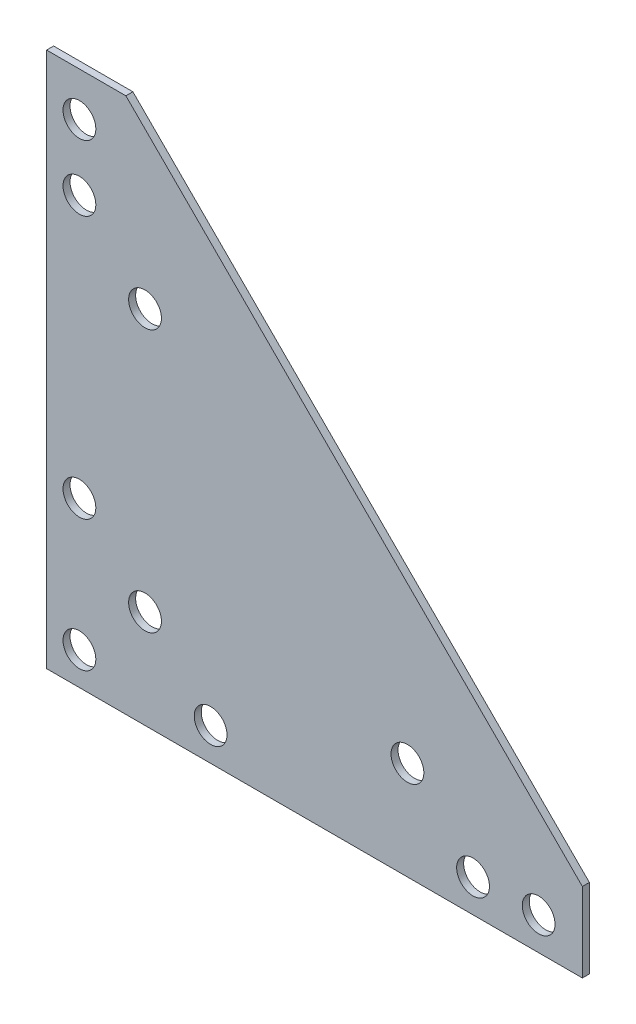
ISO-10303-21;
HEADER;
FILE_DESCRIPTION(('STEP AP214'),'2;1');
FILE_NAME('part.step','',(''),(''),'','','');
FILE_SCHEMA(('AUTOMOTIVE_DESIGN { 1 0 10303 214 1 1 1 1 }'));
ENDSEC;
DATA;
#1=APPLICATION_CONTEXT('core data for automotive mechanical design processes');
#2=APPLICATION_PROTOCOL_DEFINITION('international standard','automotive_design',2000,#1);
#3=PRODUCT_CONTEXT('',#1,'mechanical');
#4=PRODUCT('Part','Part','',(#3));
#5=PRODUCT_RELATED_PRODUCT_CATEGORY('part','',(#4));
#6=PRODUCT_DEFINITION_FORMATION('','',#4);
#7=PRODUCT_DEFINITION_CONTEXT('part definition',#1,'design');
#8=PRODUCT_DEFINITION('design','',#6,#7);
#9=PRODUCT_DEFINITION_SHAPE('','',#8);
#10=(LENGTH_UNIT() NAMED_UNIT(*) SI_UNIT(.MILLI.,.METRE.));
#11=(NAMED_UNIT(*) PLANE_ANGLE_UNIT() SI_UNIT($,.RADIAN.));
#12=(NAMED_UNIT(*) SI_UNIT($,.STERADIAN.) SOLID_ANGLE_UNIT());
#13=UNCERTAINTY_MEASURE_WITH_UNIT(LENGTH_MEASURE(1.E-05),#10,'distance_accuracy_value','');
#14=(GEOMETRIC_REPRESENTATION_CONTEXT(3) GLOBAL_UNCERTAINTY_ASSIGNED_CONTEXT((#13)) GLOBAL_UNIT_ASSIGNED_CONTEXT((#10,
#11,#12)) REPRESENTATION_CONTEXT('',''));
#15=CARTESIAN_POINT('',(0.,0.,0.));
#16=DIRECTION('',(0.,0.,1.));
#17=DIRECTION('',(1.,0.,0.));
#18=AXIS2_PLACEMENT_3D('',#15,#16,#17);
#19=CARTESIAN_POINT('',(77.7875,-54.76875,1.016));
#20=DIRECTION('',(-0.707106781186547,-0.707106781186548,0.));
#21=DIRECTION('',(0.707106781186548,-0.707106781186547,0.));
#22=AXIS2_PLACEMENT_3D('',#19,#20,#21);
#23=PLANE('',#22);
#24=DIRECTION('',(0.,0.,-1.));
#25=VECTOR('',#24,1.);
#26=CARTESIAN_POINT('',(77.7875,-54.76875,1.016));
#27=LINE('',#26,#25);
#28=CARTESIAN_POINT('',(77.7875,-54.76875,1.016));
#29=VERTEX_POINT('',#28);
#30=CARTESIAN_POINT('',(77.7875,-54.76875,-1.016));
#31=VERTEX_POINT('',#30);
#32=EDGE_CURVE('E101',#29,#31,#27,.T.);
#33=ORIENTED_EDGE('',*,*,#32,.T.);
#34=DIRECTION('',(-0.707106781186548,0.707106781186547,0.));
#35=VECTOR('',#34,1.);
#36=CARTESIAN_POINT('',(77.7875,-54.76875,-1.016));
#37=LINE('',#36,#35);
#38=CARTESIAN_POINT('',(-54.76875,77.7875,-1.016));
#39=VERTEX_POINT('',#38);
#40=EDGE_CURVE('E95',#31,#39,#37,.T.);
#41=ORIENTED_EDGE('',*,*,#40,.T.);
#42=DIRECTION('',(0.,0.,-1.));
#43=VECTOR('',#42,1.);
#44=CARTESIAN_POINT('',(-54.76875,77.7875,1.016));
#45=LINE('',#44,#43);
#46=CARTESIAN_POINT('',(-54.76875,77.7875,1.016));
#47=VERTEX_POINT('',#46);
#48=EDGE_CURVE('E11',#47,#39,#45,.T.);
#49=ORIENTED_EDGE('',*,*,#48,.F.);
#50=DIRECTION('',(-0.707106781186548,0.707106781186547,0.));
#51=VECTOR('',#50,1.);
#52=CARTESIAN_POINT('',(77.7875,-54.76875,1.016));
#53=LINE('',#52,#51);
#54=EDGE_CURVE('E117',#29,#47,#53,.T.);
#55=ORIENTED_EDGE('',*,*,#54,.F.);
#56=EDGE_LOOP('',(#33,#41,#49,#55));
#57=FACE_BOUND('',#56,.T.);
#58=ADVANCED_FACE('F37',(#57),#23,.F.);
#59=CARTESIAN_POINT('',(-54.76875,77.7875,1.016));
#60=DIRECTION('',(0.,-1.,0.));
#61=DIRECTION('',(1.,0.,0.));
#62=AXIS2_PLACEMENT_3D('',#59,#60,#61);
#63=PLANE('',#62);
#64=ORIENTED_EDGE('',*,*,#48,.T.);
#65=DIRECTION('',(-1.,0.,0.));
#66=VECTOR('',#65,1.);
#67=CARTESIAN_POINT('',(-54.76875,77.7875,-1.016));
#68=LINE('',#67,#66);
#69=CARTESIAN_POINT('',(-77.7875,77.7875,-1.016));
#70=VERTEX_POINT('',#69);
#71=EDGE_CURVE('E85',#39,#70,#68,.T.);
#72=ORIENTED_EDGE('',*,*,#71,.T.);
#73=DIRECTION('',(0.,0.,-1.));
#74=VECTOR('',#73,1.);
#75=CARTESIAN_POINT('',(-77.7875,77.7875,1.016));
#76=LINE('',#75,#74);
#77=CARTESIAN_POINT('',(-77.7875,77.7875,1.016));
#78=VERTEX_POINT('',#77);
#79=EDGE_CURVE('E44',#78,#70,#76,.T.);
#80=ORIENTED_EDGE('',*,*,#79,.F.);
#81=DIRECTION('',(-1.,0.,0.));
#82=VECTOR('',#81,1.);
#83=CARTESIAN_POINT('',(-54.76875,77.7875,1.016));
#84=LINE('',#83,#82);
#85=EDGE_CURVE('E86',#47,#78,#84,.T.);
#86=ORIENTED_EDGE('',*,*,#85,.F.);
#87=EDGE_LOOP('',(#64,#72,#80,#86));
#88=FACE_BOUND('',#87,.T.);
#89=ADVANCED_FACE('F83',(#88),#63,.F.);
#90=CARTESIAN_POINT('',(-77.7875,77.7875,1.016));
#91=DIRECTION('',(1.,0.,0.));
#92=DIRECTION('',(0.,1.,0.));
#93=AXIS2_PLACEMENT_3D('',#90,#91,#92);
#94=PLANE('',#93);
#95=ORIENTED_EDGE('',*,*,#79,.T.);
#96=DIRECTION('',(0.,-1.,0.));
#97=VECTOR('',#96,1.);
#98=CARTESIAN_POINT('',(-77.7875,77.7875,-1.016));
#99=LINE('',#98,#97);
#100=CARTESIAN_POINT('',(-77.7875,-77.7875,-1.016));
#101=VERTEX_POINT('',#100);
#102=EDGE_CURVE('E99',#70,#101,#99,.T.);
#103=ORIENTED_EDGE('',*,*,#102,.T.);
#104=DIRECTION('',(0.,0.,-1.));
#105=VECTOR('',#104,1.);
#106=CARTESIAN_POINT('',(-77.7875,-77.7875,1.016));
#107=LINE('',#106,#105);
#108=CARTESIAN_POINT('',(-77.7875,-77.7875,1.016));
#109=VERTEX_POINT('',#108);
#110=EDGE_CURVE('E127',#109,#101,#107,.T.);
#111=ORIENTED_EDGE('',*,*,#110,.F.);
#112=DIRECTION('',(0.,-1.,0.));
#113=VECTOR('',#112,1.);
#114=CARTESIAN_POINT('',(-77.7875,77.7875,1.016));
#115=LINE('',#114,#113);
#116=EDGE_CURVE('E120',#78,#109,#115,.T.);
#117=ORIENTED_EDGE('',*,*,#116,.F.);
#118=EDGE_LOOP('',(#95,#103,#111,#117));
#119=FACE_BOUND('',#118,.T.);
#120=ADVANCED_FACE('F130',(#119),#94,.F.);
#121=CARTESIAN_POINT('',(-77.7875,-77.7875,1.016));
#122=DIRECTION('',(0.,1.,0.));
#123=DIRECTION('',(0.,0.,1.));
#124=AXIS2_PLACEMENT_3D('',#121,#122,#123);
#125=PLANE('',#124);
#126=ORIENTED_EDGE('',*,*,#110,.T.);
#127=DIRECTION('',(1.,0.,0.));
#128=VECTOR('',#127,1.);
#129=CARTESIAN_POINT('',(-77.7875,-77.7875,-1.016));
#130=LINE('',#129,#128);
#131=CARTESIAN_POINT('',(77.7875,-77.7875,-1.016));
#132=VERTEX_POINT('',#131);
#133=EDGE_CURVE('E112',#101,#132,#130,.T.);
#134=ORIENTED_EDGE('',*,*,#133,.T.);
#135=DIRECTION('',(0.,0.,-1.));
#136=VECTOR('',#135,1.);
#137=CARTESIAN_POINT('',(77.7875,-77.7875,1.016));
#138=LINE('',#137,#136);
#139=CARTESIAN_POINT('',(77.7875,-77.7875,1.016));
#140=VERTEX_POINT('',#139);
#141=EDGE_CURVE('E125',#140,#132,#138,.T.);
#142=ORIENTED_EDGE('',*,*,#141,.F.);
#143=DIRECTION('',(1.,0.,0.));
#144=VECTOR('',#143,1.);
#145=CARTESIAN_POINT('',(-77.7875,-77.7875,1.016));
#146=LINE('',#145,#144);
#147=EDGE_CURVE('E56',#109,#140,#146,.T.);
#148=ORIENTED_EDGE('',*,*,#147,.F.);
#149=EDGE_LOOP('',(#126,#134,#142,#148));
#150=FACE_BOUND('',#149,.T.);
#151=ADVANCED_FACE('F144',(#150),#125,.F.);
#152=CARTESIAN_POINT('',(77.7875,-77.7875,1.016));
#153=DIRECTION('',(-1.,0.,0.));
#154=DIRECTION('',(0.,-1.,0.));
#155=AXIS2_PLACEMENT_3D('',#152,#153,#154);
#156=PLANE('',#155);
#157=ORIENTED_EDGE('',*,*,#141,.T.);
#158=DIRECTION('',(0.,1.,0.));
#159=VECTOR('',#158,1.);
#160=CARTESIAN_POINT('',(77.7875,-77.7875,-1.016));
#161=LINE('',#160,#159);
#162=EDGE_CURVE('E115',#132,#31,#161,.T.);
#163=ORIENTED_EDGE('',*,*,#162,.T.);
#164=ORIENTED_EDGE('',*,*,#32,.F.);
#165=DIRECTION('',(0.,1.,0.));
#166=VECTOR('',#165,1.);
#167=CARTESIAN_POINT('',(77.7875,-77.7875,1.016));
#168=LINE('',#167,#166);
#169=EDGE_CURVE('E51',#140,#29,#168,.T.);
#170=ORIENTED_EDGE('',*,*,#169,.F.);
#171=EDGE_LOOP('',(#157,#163,#164,#170));
#172=FACE_BOUND('',#171,.T.);
#173=ADVANCED_FACE('F134',(#172),#156,.F.);
#174=CARTESIAN_POINT('',(0.,0.,1.016));
#175=DIRECTION('',(0.,0.,1.));
#176=DIRECTION('',(1.,0.,0.));
#177=AXIS2_PLACEMENT_3D('',#174,#175,#176);
#178=PLANE('',#177);
#179=CARTESIAN_POINT('',(-68.2625,65.0875,1.016));
#180=DIRECTION('',(0.,0.,1.));
#181=DIRECTION('',(1.,0.,0.));
#182=AXIS2_PLACEMENT_3D('',#179,#180,#181);
#183=CIRCLE('',#182,4.7625);
#184=CARTESIAN_POINT('',(-63.5,65.0875,1.016));
#185=VERTEX_POINT('',#184);
#186=EDGE_CURVE('E105',#185,#185,#183,.T.);
#187=ORIENTED_EDGE('',*,*,#186,.F.);
#188=EDGE_LOOP('',(#187));
#189=FACE_BOUND('',#188,.T.);
#190=CARTESIAN_POINT('',(26.9875,-49.2125,1.016));
#191=DIRECTION('',(0.,0.,1.));
#192=DIRECTION('',(1.,0.,0.));
#193=AXIS2_PLACEMENT_3D('',#190,#191,#192);
#194=CIRCLE('',#193,4.7625);
#195=CARTESIAN_POINT('',(31.75,-49.2125,1.016));
#196=VERTEX_POINT('',#195);
#197=EDGE_CURVE('E284',#196,#196,#194,.T.);
#198=ORIENTED_EDGE('',*,*,#197,.F.);
#199=EDGE_LOOP('',(#198));
#200=FACE_BOUND('',#199,.T.);
#201=CARTESIAN_POINT('',(46.0375,-68.2625,1.016));
#202=DIRECTION('',(0.,0.,1.));
#203=DIRECTION('',(1.,0.,0.));
#204=AXIS2_PLACEMENT_3D('',#201,#202,#203);
#205=CIRCLE('',#204,4.7625);
#206=CARTESIAN_POINT('',(50.8,-68.2625,1.016));
#207=VERTEX_POINT('',#206);
#208=EDGE_CURVE('E278',#207,#207,#205,.T.);
#209=ORIENTED_EDGE('',*,*,#208,.F.);
#210=EDGE_LOOP('',(#209));
#211=FACE_BOUND('',#210,.T.);
#212=CARTESIAN_POINT('',(-30.1625,-68.2625,1.016));
#213=DIRECTION('',(0.,0.,1.));
#214=DIRECTION('',(1.,0.,0.));
#215=AXIS2_PLACEMENT_3D('',#212,#213,#214);
#216=CIRCLE('',#215,4.7625);
#217=CARTESIAN_POINT('',(-25.4,-68.2625,1.016));
#218=VERTEX_POINT('',#217);
#219=EDGE_CURVE('E272',#218,#218,#216,.T.);
#220=ORIENTED_EDGE('',*,*,#219,.F.);
#221=EDGE_LOOP('',(#220));
#222=FACE_BOUND('',#221,.T.);
#223=CARTESIAN_POINT('',(-68.2625,-68.2625,1.016));
#224=DIRECTION('',(0.,0.,1.));
#225=DIRECTION('',(1.,0.,0.));
#226=AXIS2_PLACEMENT_3D('',#223,#224,#225);
#227=CIRCLE('',#226,4.7625);
#228=CARTESIAN_POINT('',(-63.5,-68.2625,1.016));
#229=VERTEX_POINT('',#228);
#230=EDGE_CURVE('E264',#229,#229,#227,.T.);
#231=ORIENTED_EDGE('',*,*,#230,.F.);
#232=EDGE_LOOP('',(#231));
#233=FACE_BOUND('',#232,.T.);
#234=CARTESIAN_POINT('',(-49.2125,-49.2125,1.016));
#235=DIRECTION('',(0.,0.,1.));
#236=DIRECTION('',(1.,0.,0.));
#237=AXIS2_PLACEMENT_3D('',#234,#235,#236);
#238=CIRCLE('',#237,4.7625);
#239=CARTESIAN_POINT('',(-44.45,-49.2125,1.016));
#240=VERTEX_POINT('',#239);
#241=EDGE_CURVE('E271',#240,#240,#238,.T.);
#242=ORIENTED_EDGE('',*,*,#241,.F.);
#243=EDGE_LOOP('',(#242));
#244=FACE_BOUND('',#243,.T.);
#245=CARTESIAN_POINT('',(-49.2125,26.9875,1.016));
#246=DIRECTION('',(0.,0.,1.));
#247=DIRECTION('',(1.,0.,0.));
#248=AXIS2_PLACEMENT_3D('',#245,#246,#247);
#249=CIRCLE('',#248,4.7625);
#250=CARTESIAN_POINT('',(-44.45,26.9875,1.016));
#251=VERTEX_POINT('',#250);
#252=EDGE_CURVE('E298',#251,#251,#249,.T.);
#253=ORIENTED_EDGE('',*,*,#252,.F.);
#254=EDGE_LOOP('',(#253));
#255=FACE_BOUND('',#254,.T.);
#256=CARTESIAN_POINT('',(-68.2625,-30.1625,1.016));
#257=DIRECTION('',(0.,0.,1.));
#258=DIRECTION('',(1.,0.,0.));
#259=AXIS2_PLACEMENT_3D('',#256,#257,#258);
#260=CIRCLE('',#259,4.7625);
#261=CARTESIAN_POINT('',(-63.5,-30.1625,1.016));
#262=VERTEX_POINT('',#261);
#263=EDGE_CURVE('E292',#262,#262,#260,.T.);
#264=ORIENTED_EDGE('',*,*,#263,.F.);
#265=EDGE_LOOP('',(#264));
#266=FACE_BOUND('',#265,.T.);
#267=CARTESIAN_POINT('',(-68.2625,46.0375,1.016));
#268=DIRECTION('',(0.,0.,1.));
#269=DIRECTION('',(1.,0.,0.));
#270=AXIS2_PLACEMENT_3D('',#267,#268,#269);
#271=CIRCLE('',#270,4.7625);
#272=CARTESIAN_POINT('',(-63.5,46.0375,1.016));
#273=VERTEX_POINT('',#272);
#274=EDGE_CURVE('E261',#273,#273,#271,.T.);
#275=ORIENTED_EDGE('',*,*,#274,.F.);
#276=EDGE_LOOP('',(#275));
#277=FACE_BOUND('',#276,.T.);
#278=CARTESIAN_POINT('',(65.0875,-68.2625,1.016));
#279=DIRECTION('',(0.,0.,1.));
#280=DIRECTION('',(1.,0.,0.));
#281=AXIS2_PLACEMENT_3D('',#278,#279,#280);
#282=CIRCLE('',#281,4.7625);
#283=CARTESIAN_POINT('',(69.85,-68.2625,1.016));
#284=VERTEX_POINT('',#283);
#285=EDGE_CURVE('E307',#284,#284,#282,.T.);
#286=ORIENTED_EDGE('',*,*,#285,.F.);
#287=EDGE_LOOP('',(#286));
#288=FACE_BOUND('',#287,.T.);
#289=ORIENTED_EDGE('',*,*,#54,.T.);
#290=ORIENTED_EDGE('',*,*,#85,.T.);
#291=ORIENTED_EDGE('',*,*,#116,.T.);
#292=ORIENTED_EDGE('',*,*,#147,.T.);
#293=ORIENTED_EDGE('',*,*,#169,.T.);
#294=EDGE_LOOP('',(#289,#290,#291,#292,#293));
#295=FACE_BOUND('',#294,.T.);
#296=ADVANCED_FACE('F132',(#189,#200,#211,#222,#233,#244,#255,#266,#277,#288,#295),#178,.T.);
#297=CARTESIAN_POINT('',(0.,0.,-1.016));
#298=DIRECTION('',(0.,0.,1.));
#299=DIRECTION('',(1.,0.,0.));
#300=AXIS2_PLACEMENT_3D('',#297,#298,#299);
#301=PLANE('',#300);
#302=CARTESIAN_POINT('',(-68.2625,65.0875,-1.016));
#303=DIRECTION('',(0.,0.,1.));
#304=DIRECTION('',(1.,0.,0.));
#305=AXIS2_PLACEMENT_3D('',#302,#303,#304);
#306=CIRCLE('',#305,4.7625);
#307=CARTESIAN_POINT('',(-63.5,65.0875,-1.016));
#308=VERTEX_POINT('',#307);
#309=EDGE_CURVE('E102',#308,#308,#306,.T.);
#310=ORIENTED_EDGE('',*,*,#309,.T.);
#311=EDGE_LOOP('',(#310));
#312=FACE_BOUND('',#311,.T.);
#313=CARTESIAN_POINT('',(26.9875,-49.2125,-1.016));
#314=DIRECTION('',(0.,0.,1.));
#315=DIRECTION('',(1.,0.,0.));
#316=AXIS2_PLACEMENT_3D('',#313,#314,#315);
#317=CIRCLE('',#316,4.7625);
#318=CARTESIAN_POINT('',(31.75,-49.2125,-1.016));
#319=VERTEX_POINT('',#318);
#320=EDGE_CURVE('E281',#319,#319,#317,.T.);
#321=ORIENTED_EDGE('',*,*,#320,.T.);
#322=EDGE_LOOP('',(#321));
#323=FACE_BOUND('',#322,.T.);
#324=CARTESIAN_POINT('',(46.0375,-68.2625,-1.016));
#325=DIRECTION('',(0.,0.,1.));
#326=DIRECTION('',(1.,0.,0.));
#327=AXIS2_PLACEMENT_3D('',#324,#325,#326);
#328=CIRCLE('',#327,4.7625);
#329=CARTESIAN_POINT('',(50.8,-68.2625,-1.016));
#330=VERTEX_POINT('',#329);
#331=EDGE_CURVE('E275',#330,#330,#328,.T.);
#332=ORIENTED_EDGE('',*,*,#331,.T.);
#333=EDGE_LOOP('',(#332));
#334=FACE_BOUND('',#333,.T.);
#335=CARTESIAN_POINT('',(-30.1625,-68.2625,-1.016));
#336=DIRECTION('',(0.,0.,1.));
#337=DIRECTION('',(1.,0.,0.));
#338=AXIS2_PLACEMENT_3D('',#335,#336,#337);
#339=CIRCLE('',#338,4.7625);
#340=CARTESIAN_POINT('',(-25.4,-68.2625,-1.016));
#341=VERTEX_POINT('',#340);
#342=EDGE_CURVE('E268',#341,#341,#339,.T.);
#343=ORIENTED_EDGE('',*,*,#342,.T.);
#344=EDGE_LOOP('',(#343));
#345=FACE_BOUND('',#344,.T.);
#346=CARTESIAN_POINT('',(-68.2625,-68.2625,-1.016));
#347=DIRECTION('',(0.,0.,1.));
#348=DIRECTION('',(1.,0.,0.));
#349=AXIS2_PLACEMENT_3D('',#346,#347,#348);
#350=CIRCLE('',#349,4.7625);
#351=CARTESIAN_POINT('',(-63.5,-68.2625,-1.016));
#352=VERTEX_POINT('',#351);
#353=EDGE_CURVE('E267',#352,#352,#350,.T.);
#354=ORIENTED_EDGE('',*,*,#353,.T.);
#355=EDGE_LOOP('',(#354));
#356=FACE_BOUND('',#355,.T.);
#357=CARTESIAN_POINT('',(-49.2125,-49.2125,-1.016));
#358=DIRECTION('',(0.,0.,1.));
#359=DIRECTION('',(1.,0.,0.));
#360=AXIS2_PLACEMENT_3D('',#357,#358,#359);
#361=CIRCLE('',#360,4.7625);
#362=CARTESIAN_POINT('',(-44.45,-49.2125,-1.016));
#363=VERTEX_POINT('',#362);
#364=EDGE_CURVE('E301',#363,#363,#361,.T.);
#365=ORIENTED_EDGE('',*,*,#364,.T.);
#366=EDGE_LOOP('',(#365));
#367=FACE_BOUND('',#366,.T.);
#368=CARTESIAN_POINT('',(-49.2125,26.9875,-1.016));
#369=DIRECTION('',(0.,0.,1.));
#370=DIRECTION('',(1.,0.,0.));
#371=AXIS2_PLACEMENT_3D('',#368,#369,#370);
#372=CIRCLE('',#371,4.7625);
#373=CARTESIAN_POINT('',(-44.45,26.9875,-1.016));
#374=VERTEX_POINT('',#373);
#375=EDGE_CURVE('E295',#374,#374,#372,.T.);
#376=ORIENTED_EDGE('',*,*,#375,.T.);
#377=EDGE_LOOP('',(#376));
#378=FACE_BOUND('',#377,.T.);
#379=CARTESIAN_POINT('',(-68.2625,-30.1625,-1.016));
#380=DIRECTION('',(0.,0.,1.));
#381=DIRECTION('',(1.,0.,0.));
#382=AXIS2_PLACEMENT_3D('',#379,#380,#381);
#383=CIRCLE('',#382,4.7625);
#384=CARTESIAN_POINT('',(-63.5,-30.1625,-1.016));
#385=VERTEX_POINT('',#384);
#386=EDGE_CURVE('E290',#385,#385,#383,.T.);
#387=ORIENTED_EDGE('',*,*,#386,.T.);
#388=EDGE_LOOP('',(#387));
#389=FACE_BOUND('',#388,.T.);
#390=CARTESIAN_POINT('',(-68.2625,46.0375,-1.016));
#391=DIRECTION('',(0.,0.,1.));
#392=DIRECTION('',(1.,0.,0.));
#393=AXIS2_PLACEMENT_3D('',#390,#391,#392);
#394=CIRCLE('',#393,4.7625);
#395=CARTESIAN_POINT('',(-63.5,46.0375,-1.016));
#396=VERTEX_POINT('',#395);
#397=EDGE_CURVE('E258',#396,#396,#394,.T.);
#398=ORIENTED_EDGE('',*,*,#397,.T.);
#399=EDGE_LOOP('',(#398));
#400=FACE_BOUND('',#399,.T.);
#401=CARTESIAN_POINT('',(65.0875,-68.2625,-1.016));
#402=DIRECTION('',(0.,0.,1.));
#403=DIRECTION('',(1.,0.,0.));
#404=AXIS2_PLACEMENT_3D('',#401,#402,#403);
#405=CIRCLE('',#404,4.7625);
#406=CARTESIAN_POINT('',(69.85,-68.2625,-1.016));
#407=VERTEX_POINT('',#406);
#408=EDGE_CURVE('E108',#407,#407,#405,.T.);
#409=ORIENTED_EDGE('',*,*,#408,.T.);
#410=EDGE_LOOP('',(#409));
#411=FACE_BOUND('',#410,.T.);
#412=ORIENTED_EDGE('',*,*,#40,.F.);
#413=ORIENTED_EDGE('',*,*,#162,.F.);
#414=ORIENTED_EDGE('',*,*,#133,.F.);
#415=ORIENTED_EDGE('',*,*,#102,.F.);
#416=ORIENTED_EDGE('',*,*,#71,.F.);
#417=EDGE_LOOP('',(#412,#413,#414,#415,#416));
#418=FACE_BOUND('',#417,.T.);
#419=ADVANCED_FACE('F93',(#312,#323,#334,#345,#356,#367,#378,#389,#400,#411,#418),#301,.F.);
#420=CARTESIAN_POINT('',(65.0875,-68.2625,-1.016));
#421=DIRECTION('',(0.,0.,1.));
#422=DIRECTION('',(1.,0.,0.));
#423=AXIS2_PLACEMENT_3D('',#420,#421,#422);
#424=CYLINDRICAL_SURFACE('',#423,4.7625);
#425=ORIENTED_EDGE('',*,*,#408,.F.);
#426=EDGE_LOOP('',(#425));
#427=FACE_BOUND('',#426,.T.);
#428=ORIENTED_EDGE('',*,*,#285,.T.);
#429=EDGE_LOOP('',(#428));
#430=FACE_BOUND('',#429,.T.);
#431=ADVANCED_FACE('F141',(#427,#430),#424,.F.);
#432=CARTESIAN_POINT('',(-68.2625,46.0375,-1.016));
#433=DIRECTION('',(0.,0.,1.));
#434=DIRECTION('',(1.,0.,0.));
#435=AXIS2_PLACEMENT_3D('',#432,#433,#434);
#436=CYLINDRICAL_SURFACE('',#435,4.7625);
#437=ORIENTED_EDGE('',*,*,#397,.F.);
#438=EDGE_LOOP('',(#437));
#439=FACE_BOUND('',#438,.T.);
#440=ORIENTED_EDGE('',*,*,#274,.T.);
#441=EDGE_LOOP('',(#440));
#442=FACE_BOUND('',#441,.T.);
#443=ADVANCED_FACE('F181',(#439,#442),#436,.F.);
#444=CARTESIAN_POINT('',(-68.2625,-30.1625,-1.016));
#445=DIRECTION('',(0.,0.,1.));
#446=DIRECTION('',(1.,0.,0.));
#447=AXIS2_PLACEMENT_3D('',#444,#445,#446);
#448=CYLINDRICAL_SURFACE('',#447,4.7625);
#449=ORIENTED_EDGE('',*,*,#386,.F.);
#450=EDGE_LOOP('',(#449));
#451=FACE_BOUND('',#450,.T.);
#452=ORIENTED_EDGE('',*,*,#263,.T.);
#453=EDGE_LOOP('',(#452));
#454=FACE_BOUND('',#453,.T.);
#455=ADVANCED_FACE('F189',(#451,#454),#448,.F.);
#456=CARTESIAN_POINT('',(-49.2125,26.9875,-1.016));
#457=DIRECTION('',(0.,0.,1.));
#458=DIRECTION('',(1.,0.,0.));
#459=AXIS2_PLACEMENT_3D('',#456,#457,#458);
#460=CYLINDRICAL_SURFACE('',#459,4.7625);
#461=ORIENTED_EDGE('',*,*,#375,.F.);
#462=EDGE_LOOP('',(#461));
#463=FACE_BOUND('',#462,.T.);
#464=ORIENTED_EDGE('',*,*,#252,.T.);
#465=EDGE_LOOP('',(#464));
#466=FACE_BOUND('',#465,.T.);
#467=ADVANCED_FACE('F197',(#463,#466),#460,.F.);
#468=CARTESIAN_POINT('',(-49.2125,-49.2125,-1.016));
#469=DIRECTION('',(0.,0.,1.));
#470=DIRECTION('',(1.,0.,0.));
#471=AXIS2_PLACEMENT_3D('',#468,#469,#470);
#472=CYLINDRICAL_SURFACE('',#471,4.7625);
#473=ORIENTED_EDGE('',*,*,#364,.F.);
#474=EDGE_LOOP('',(#473));
#475=FACE_BOUND('',#474,.T.);
#476=ORIENTED_EDGE('',*,*,#241,.T.);
#477=EDGE_LOOP('',(#476));
#478=FACE_BOUND('',#477,.T.);
#479=ADVANCED_FACE('F205',(#475,#478),#472,.F.);
#480=CARTESIAN_POINT('',(-68.2625,-68.2625,-1.016));
#481=DIRECTION('',(0.,0.,1.));
#482=DIRECTION('',(1.,0.,0.));
#483=AXIS2_PLACEMENT_3D('',#480,#481,#482);
#484=CYLINDRICAL_SURFACE('',#483,4.7625);
#485=ORIENTED_EDGE('',*,*,#353,.F.);
#486=EDGE_LOOP('',(#485));
#487=FACE_BOUND('',#486,.T.);
#488=ORIENTED_EDGE('',*,*,#230,.T.);
#489=EDGE_LOOP('',(#488));
#490=FACE_BOUND('',#489,.T.);
#491=ADVANCED_FACE('F213',(#487,#490),#484,.F.);
#492=CARTESIAN_POINT('',(-30.1625,-68.2625,-1.016));
#493=DIRECTION('',(0.,0.,1.));
#494=DIRECTION('',(1.,0.,0.));
#495=AXIS2_PLACEMENT_3D('',#492,#493,#494);
#496=CYLINDRICAL_SURFACE('',#495,4.7625);
#497=ORIENTED_EDGE('',*,*,#342,.F.);
#498=EDGE_LOOP('',(#497));
#499=FACE_BOUND('',#498,.T.);
#500=ORIENTED_EDGE('',*,*,#219,.T.);
#501=EDGE_LOOP('',(#500));
#502=FACE_BOUND('',#501,.T.);
#503=ADVANCED_FACE('F221',(#499,#502),#496,.F.);
#504=CARTESIAN_POINT('',(46.0375,-68.2625,-1.016));
#505=DIRECTION('',(0.,0.,1.));
#506=DIRECTION('',(1.,0.,0.));
#507=AXIS2_PLACEMENT_3D('',#504,#505,#506);
#508=CYLINDRICAL_SURFACE('',#507,4.7625);
#509=ORIENTED_EDGE('',*,*,#331,.F.);
#510=EDGE_LOOP('',(#509));
#511=FACE_BOUND('',#510,.T.);
#512=ORIENTED_EDGE('',*,*,#208,.T.);
#513=EDGE_LOOP('',(#512));
#514=FACE_BOUND('',#513,.T.);
#515=ADVANCED_FACE('F229',(#511,#514),#508,.F.);
#516=CARTESIAN_POINT('',(26.9875,-49.2125,-1.016));
#517=DIRECTION('',(0.,0.,1.));
#518=DIRECTION('',(1.,0.,0.));
#519=AXIS2_PLACEMENT_3D('',#516,#517,#518);
#520=CYLINDRICAL_SURFACE('',#519,4.7625);
#521=ORIENTED_EDGE('',*,*,#320,.F.);
#522=EDGE_LOOP('',(#521));
#523=FACE_BOUND('',#522,.T.);
#524=ORIENTED_EDGE('',*,*,#197,.T.);
#525=EDGE_LOOP('',(#524));
#526=FACE_BOUND('',#525,.T.);
#527=ADVANCED_FACE('F237',(#523,#526),#520,.F.);
#528=CARTESIAN_POINT('',(-68.2625,65.0875,-1.016));
#529=DIRECTION('',(0.,0.,1.));
#530=DIRECTION('',(1.,0.,0.));
#531=AXIS2_PLACEMENT_3D('',#528,#529,#530);
#532=CYLINDRICAL_SURFACE('',#531,4.7625);
#533=ORIENTED_EDGE('',*,*,#309,.F.);
#534=EDGE_LOOP('',(#533));
#535=FACE_BOUND('',#534,.T.);
#536=ORIENTED_EDGE('',*,*,#186,.T.);
#537=EDGE_LOOP('',(#536));
#538=FACE_BOUND('',#537,.T.);
#539=ADVANCED_FACE('F245',(#535,#538),#532,.F.);
#540=CLOSED_SHELL('',(#58,#89,#120,#151,#173,#296,#419,#431,#443,#455,#467,#479,#491,#503,#515,
#527,#539));
#541=MANIFOLD_SOLID_BREP('B2',#540);
#542=ADVANCED_BREP_SHAPE_REPRESENTATION('',(#18,#541),#14);
#543=SHAPE_DEFINITION_REPRESENTATION(#9,#542);
ENDSEC;
END-ISO-10303-21;
